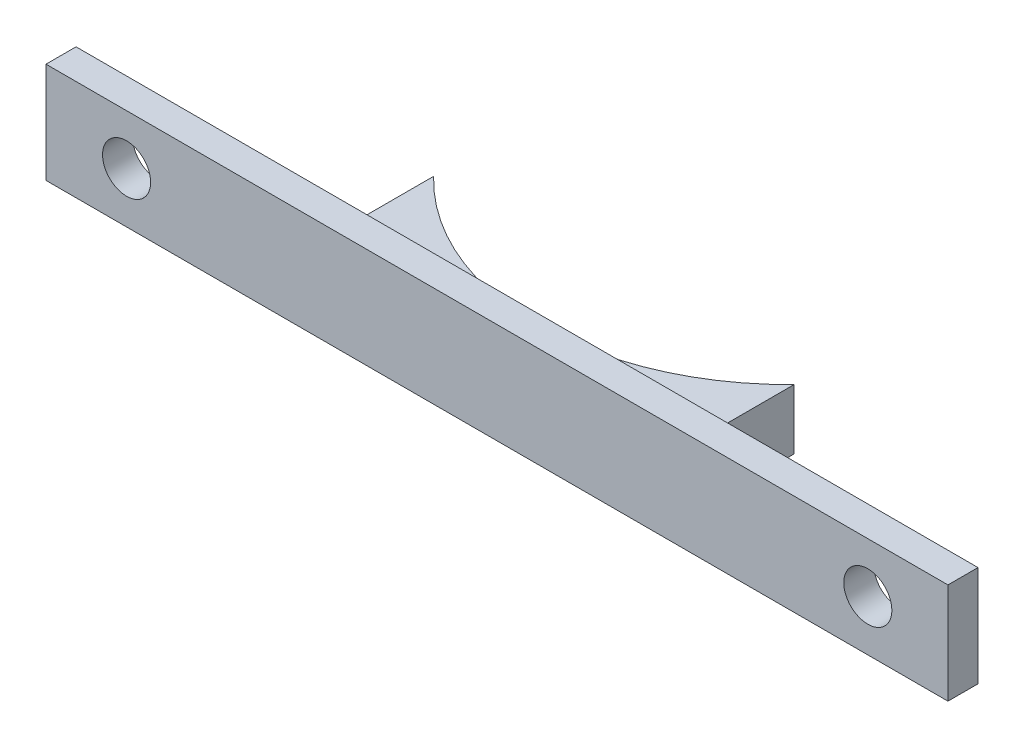
ISO-10303-21;
HEADER;
FILE_DESCRIPTION(('STEP AP214'),'2;1');
FILE_NAME('part.step','',(''),(''),'','','');
FILE_SCHEMA(('AUTOMOTIVE_DESIGN { 1 0 10303 214 1 1 1 1 }'));
ENDSEC;
DATA;
#1=APPLICATION_CONTEXT('core data for automotive mechanical design processes');
#2=APPLICATION_PROTOCOL_DEFINITION('international standard','automotive_design',2000,#1);
#3=PRODUCT_CONTEXT('',#1,'mechanical');
#4=PRODUCT('Part','Part','',(#3));
#5=PRODUCT_RELATED_PRODUCT_CATEGORY('part','',(#4));
#6=PRODUCT_DEFINITION_FORMATION('','',#4);
#7=PRODUCT_DEFINITION_CONTEXT('part definition',#1,'design');
#8=PRODUCT_DEFINITION('design','',#6,#7);
#9=PRODUCT_DEFINITION_SHAPE('','',#8);
#10=(LENGTH_UNIT() NAMED_UNIT(*) SI_UNIT(.MILLI.,.METRE.));
#11=(NAMED_UNIT(*) PLANE_ANGLE_UNIT() SI_UNIT($,.RADIAN.));
#12=(NAMED_UNIT(*) SI_UNIT($,.STERADIAN.) SOLID_ANGLE_UNIT());
#13=UNCERTAINTY_MEASURE_WITH_UNIT(LENGTH_MEASURE(1.E-05),#10,'distance_accuracy_value','');
#14=(GEOMETRIC_REPRESENTATION_CONTEXT(3) GLOBAL_UNCERTAINTY_ASSIGNED_CONTEXT((#13)) GLOBAL_UNIT_ASSIGNED_CONTEXT((#10,
#11,#12)) REPRESENTATION_CONTEXT('',''));
#15=CARTESIAN_POINT('',(0.,0.,0.));
#16=DIRECTION('',(0.,0.,1.));
#17=DIRECTION('',(1.,0.,0.));
#18=AXIS2_PLACEMENT_3D('',#15,#16,#17);
#19=CARTESIAN_POINT('',(0.,0.,0.));
#20=DIRECTION('',(0.,0.,1.));
#21=DIRECTION('',(1.,0.,0.));
#22=AXIS2_PLACEMENT_3D('',#19,#20,#21);
#23=PLANE('',#22);
#24=CARTESIAN_POINT('',(46.99,0.,0.));
#25=DIRECTION('',(0.,0.,1.));
#26=DIRECTION('',(1.,0.,0.));
#27=AXIS2_PLACEMENT_3D('',#24,#25,#26);
#28=CIRCLE('',#27,3.048);
#29=CARTESIAN_POINT('',(50.038,0.,0.));
#30=VERTEX_POINT('',#29);
#31=EDGE_CURVE('E169',#30,#30,#28,.T.);
#32=ORIENTED_EDGE('',*,*,#31,.T.);
#33=EDGE_LOOP('',(#32));
#34=FACE_BOUND('',#33,.T.);
#35=DIRECTION('',(1.,0.,0.));
#36=VECTOR('',#35,1.);
#37=CARTESIAN_POINT('',(0.,-6.41832615647092,0.));
#38=LINE('',#37,#36);
#39=CARTESIAN_POINT('',(-57.2065757126817,-6.41832615647092,0.));
#40=VERTEX_POINT('',#39);
#41=CARTESIAN_POINT('',(57.15,-6.41832615647092,0.));
#42=VERTEX_POINT('',#41);
#43=EDGE_CURVE('E188',#40,#42,#38,.T.);
#44=ORIENTED_EDGE('',*,*,#43,.F.);
#45=DIRECTION('',(0.,1.,0.));
#46=VECTOR('',#45,1.);
#47=CARTESIAN_POINT('',(-57.2065757126817,0.,0.));
#48=LINE('',#47,#46);
#49=CARTESIAN_POINT('',(-57.2065757126817,6.35,0.));
#50=VERTEX_POINT('',#49);
#51=EDGE_CURVE('E199',#40,#50,#48,.T.);
#52=ORIENTED_EDGE('',*,*,#51,.T.);
#53=DIRECTION('',(1.,0.,0.));
#54=VECTOR('',#53,1.);
#55=CARTESIAN_POINT('',(0.,6.35,0.));
#56=LINE('',#55,#54);
#57=CARTESIAN_POINT('',(57.15,6.35,0.));
#58=VERTEX_POINT('',#57);
#59=EDGE_CURVE('E195',#50,#58,#56,.T.);
#60=ORIENTED_EDGE('',*,*,#59,.T.);
#61=DIRECTION('',(0.,1.,0.));
#62=VECTOR('',#61,1.);
#63=CARTESIAN_POINT('',(57.15,0.,0.));
#64=LINE('',#63,#62);
#65=EDGE_CURVE('E191',#42,#58,#64,.T.);
#66=ORIENTED_EDGE('',*,*,#65,.F.);
#67=EDGE_LOOP('',(#44,#52,#60,#66));
#68=FACE_BOUND('',#67,.T.);
#69=CARTESIAN_POINT('',(-46.99,0.,0.));
#70=DIRECTION('',(0.,0.,1.));
#71=DIRECTION('',(1.,0.,0.));
#72=AXIS2_PLACEMENT_3D('',#69,#70,#71);
#73=CIRCLE('',#72,3.048);
#74=CARTESIAN_POINT('',(-43.942,0.,0.));
#75=VERTEX_POINT('',#74);
#76=EDGE_CURVE('E157',#75,#75,#73,.T.);
#77=ORIENTED_EDGE('',*,*,#76,.T.);
#78=EDGE_LOOP('',(#77));
#79=FACE_BOUND('',#78,.T.);
#80=DIRECTION('',(-1.,0.,0.));
#81=VECTOR('',#80,1.);
#82=CARTESIAN_POINT('',(0.,-3.81,0.));
#83=LINE('',#82,#81);
#84=CARTESIAN_POINT('',(22.86,-3.81,0.));
#85=VERTEX_POINT('',#84);
#86=CARTESIAN_POINT('',(-22.86,-3.81,0.));
#87=VERTEX_POINT('',#86);
#88=EDGE_CURVE('E149',#85,#87,#83,.T.);
#89=ORIENTED_EDGE('',*,*,#88,.F.);
#90=DIRECTION('',(0.,1.,0.));
#91=VECTOR('',#90,1.);
#92=CARTESIAN_POINT('',(22.86,-3.81,0.));
#93=LINE('',#92,#91);
#94=CARTESIAN_POINT('',(22.86,3.81,0.));
#95=VERTEX_POINT('',#94);
#96=EDGE_CURVE('E158',#85,#95,#93,.T.);
#97=ORIENTED_EDGE('',*,*,#96,.T.);
#98=DIRECTION('',(-1.,0.,0.));
#99=VECTOR('',#98,1.);
#100=CARTESIAN_POINT('',(0.,3.81,0.));
#101=LINE('',#100,#99);
#102=CARTESIAN_POINT('',(-22.86,3.81,0.));
#103=VERTEX_POINT('',#102);
#104=EDGE_CURVE('E132',#95,#103,#101,.T.);
#105=ORIENTED_EDGE('',*,*,#104,.T.);
#106=DIRECTION('',(0.,1.,0.));
#107=VECTOR('',#106,1.);
#108=CARTESIAN_POINT('',(-22.86,-3.81,0.));
#109=LINE('',#108,#107);
#110=EDGE_CURVE('E125',#87,#103,#109,.T.);
#111=ORIENTED_EDGE('',*,*,#110,.F.);
#112=EDGE_LOOP('',(#89,#97,#105,#111));
#113=FACE_BOUND('',#112,.T.);
#114=ADVANCED_FACE('F39',(#34,#68,#79,#113),#23,.F.);
#115=CARTESIAN_POINT('',(0.,-6.41832615647092,3.81));
#116=DIRECTION('',(0.,1.,0.));
#117=DIRECTION('',(0.,0.,1.));
#118=AXIS2_PLACEMENT_3D('',#115,#116,#117);
#119=PLANE('',#118);
#120=ORIENTED_EDGE('',*,*,#43,.T.);
#121=DIRECTION('',(0.,0.,-1.));
#122=VECTOR('',#121,1.);
#123=CARTESIAN_POINT('',(57.15,-6.41832615647092,3.81));
#124=LINE('',#123,#122);
#125=CARTESIAN_POINT('',(57.15,-6.41832615647092,3.81));
#126=VERTEX_POINT('',#125);
#127=EDGE_CURVE('E11',#126,#42,#124,.T.);
#128=ORIENTED_EDGE('',*,*,#127,.F.);
#129=DIRECTION('',(1.,0.,0.));
#130=VECTOR('',#129,1.);
#131=CARTESIAN_POINT('',(0.,-6.41832615647092,3.81));
#132=LINE('',#131,#130);
#133=CARTESIAN_POINT('',(-57.2065757126817,-6.41832615647092,3.81));
#134=VERTEX_POINT('',#133);
#135=EDGE_CURVE('E168',#134,#126,#132,.T.);
#136=ORIENTED_EDGE('',*,*,#135,.F.);
#137=DIRECTION('',(0.,0.,-1.));
#138=VECTOR('',#137,1.);
#139=CARTESIAN_POINT('',(-57.2065757126817,-6.41832615647092,3.81));
#140=LINE('',#139,#138);
#141=EDGE_CURVE('E64',#134,#40,#140,.T.);
#142=ORIENTED_EDGE('',*,*,#141,.T.);
#143=EDGE_LOOP('',(#120,#128,#136,#142));
#144=FACE_BOUND('',#143,.T.);
#145=ADVANCED_FACE('F224',(#144),#119,.F.);
#146=CARTESIAN_POINT('',(57.15,0.,3.81));
#147=DIRECTION('',(-1.,0.,0.));
#148=DIRECTION('',(0.,0.,1.));
#149=AXIS2_PLACEMENT_3D('',#146,#147,#148);
#150=PLANE('',#149);
#151=ORIENTED_EDGE('',*,*,#65,.T.);
#152=DIRECTION('',(0.,0.,-1.));
#153=VECTOR('',#152,1.);
#154=CARTESIAN_POINT('',(57.15,6.35,3.81));
#155=LINE('',#154,#153);
#156=CARTESIAN_POINT('',(57.15,6.35,3.81));
#157=VERTEX_POINT('',#156);
#158=EDGE_CURVE('E48',#157,#58,#155,.T.);
#159=ORIENTED_EDGE('',*,*,#158,.F.);
#160=DIRECTION('',(0.,1.,0.));
#161=VECTOR('',#160,1.);
#162=CARTESIAN_POINT('',(57.15,0.,3.81));
#163=LINE('',#162,#161);
#164=EDGE_CURVE('E90',#126,#157,#163,.T.);
#165=ORIENTED_EDGE('',*,*,#164,.F.);
#166=ORIENTED_EDGE('',*,*,#127,.T.);
#167=EDGE_LOOP('',(#151,#159,#165,#166));
#168=FACE_BOUND('',#167,.T.);
#169=ADVANCED_FACE('F215',(#168),#150,.F.);
#170=CARTESIAN_POINT('',(0.,6.35,3.81));
#171=DIRECTION('',(0.,1.,0.));
#172=DIRECTION('',(0.,0.,1.));
#173=AXIS2_PLACEMENT_3D('',#170,#171,#172);
#174=PLANE('',#173);
#175=ORIENTED_EDGE('',*,*,#59,.F.);
#176=DIRECTION('',(0.,0.,-1.));
#177=VECTOR('',#176,1.);
#178=CARTESIAN_POINT('',(-57.2065757126817,6.35,3.81));
#179=LINE('',#178,#177);
#180=CARTESIAN_POINT('',(-57.2065757126817,6.35,3.81));
#181=VERTEX_POINT('',#180);
#182=EDGE_CURVE('E208',#181,#50,#179,.T.);
#183=ORIENTED_EDGE('',*,*,#182,.F.);
#184=DIRECTION('',(1.,0.,0.));
#185=VECTOR('',#184,1.);
#186=CARTESIAN_POINT('',(0.,6.35,3.81));
#187=LINE('',#186,#185);
#188=EDGE_CURVE('E174',#181,#157,#187,.T.);
#189=ORIENTED_EDGE('',*,*,#188,.T.);
#190=ORIENTED_EDGE('',*,*,#158,.T.);
#191=EDGE_LOOP('',(#175,#183,#189,#190));
#192=FACE_BOUND('',#191,.T.);
#193=ADVANCED_FACE('F213',(#192),#174,.T.);
#194=CARTESIAN_POINT('',(-57.2065757126817,0.,3.81));
#195=DIRECTION('',(-1.,0.,0.));
#196=DIRECTION('',(0.,0.,1.));
#197=AXIS2_PLACEMENT_3D('',#194,#195,#196);
#198=PLANE('',#197);
#199=ORIENTED_EDGE('',*,*,#51,.F.);
#200=ORIENTED_EDGE('',*,*,#141,.F.);
#201=DIRECTION('',(0.,1.,0.));
#202=VECTOR('',#201,1.);
#203=CARTESIAN_POINT('',(-57.2065757126817,0.,3.81));
#204=LINE('',#203,#202);
#205=EDGE_CURVE('E178',#134,#181,#204,.T.);
#206=ORIENTED_EDGE('',*,*,#205,.T.);
#207=ORIENTED_EDGE('',*,*,#182,.T.);
#208=EDGE_LOOP('',(#199,#200,#206,#207));
#209=FACE_BOUND('',#208,.T.);
#210=ADVANCED_FACE('F219',(#209),#198,.T.);
#211=CARTESIAN_POINT('',(-46.99,0.,3.81));
#212=DIRECTION('',(0.,0.,-1.));
#213=DIRECTION('',(-1.,0.,0.));
#214=AXIS2_PLACEMENT_3D('',#211,#212,#213);
#215=CYLINDRICAL_SURFACE('',#214,3.048);
#216=CARTESIAN_POINT('',(-46.99,0.,3.81));
#217=DIRECTION('',(0.,0.,1.));
#218=DIRECTION('',(1.,0.,0.));
#219=AXIS2_PLACEMENT_3D('',#216,#217,#218);
#220=CIRCLE('',#219,3.048);
#221=CARTESIAN_POINT('',(-43.942,0.,3.81));
#222=VERTEX_POINT('',#221);
#223=EDGE_CURVE('E164',#222,#222,#220,.T.);
#224=ORIENTED_EDGE('',*,*,#223,.T.);
#225=EDGE_LOOP('',(#224));
#226=FACE_BOUND('',#225,.T.);
#227=ORIENTED_EDGE('',*,*,#76,.F.);
#228=EDGE_LOOP('',(#227));
#229=FACE_BOUND('',#228,.T.);
#230=ADVANCED_FACE('F41',(#226,#229),#215,.F.);
#231=CARTESIAN_POINT('',(46.99,0.,3.81));
#232=DIRECTION('',(0.,0.,-1.));
#233=DIRECTION('',(-1.,0.,0.));
#234=AXIS2_PLACEMENT_3D('',#231,#232,#233);
#235=CYLINDRICAL_SURFACE('',#234,3.048);
#236=CARTESIAN_POINT('',(46.99,0.,3.81));
#237=DIRECTION('',(0.,0.,1.));
#238=DIRECTION('',(1.,0.,0.));
#239=AXIS2_PLACEMENT_3D('',#236,#237,#238);
#240=CIRCLE('',#239,3.048);
#241=CARTESIAN_POINT('',(50.038,0.,3.81));
#242=VERTEX_POINT('',#241);
#243=EDGE_CURVE('E181',#242,#242,#240,.T.);
#244=ORIENTED_EDGE('',*,*,#243,.T.);
#245=EDGE_LOOP('',(#244));
#246=FACE_BOUND('',#245,.T.);
#247=ORIENTED_EDGE('',*,*,#31,.F.);
#248=EDGE_LOOP('',(#247));
#249=FACE_BOUND('',#248,.T.);
#250=ADVANCED_FACE('F238',(#246,#249),#235,.F.);
#251=CARTESIAN_POINT('',(0.,0.,3.81));
#252=DIRECTION('',(0.,0.,1.));
#253=DIRECTION('',(1.,0.,0.));
#254=AXIS2_PLACEMENT_3D('',#251,#252,#253);
#255=PLANE('',#254);
#256=ORIENTED_EDGE('',*,*,#223,.F.);
#257=EDGE_LOOP('',(#256));
#258=FACE_BOUND('',#257,.T.);
#259=ORIENTED_EDGE('',*,*,#135,.T.);
#260=ORIENTED_EDGE('',*,*,#164,.T.);
#261=ORIENTED_EDGE('',*,*,#188,.F.);
#262=ORIENTED_EDGE('',*,*,#205,.F.);
#263=EDGE_LOOP('',(#259,#260,#261,#262));
#264=FACE_BOUND('',#263,.T.);
#265=ORIENTED_EDGE('',*,*,#243,.F.);
#266=EDGE_LOOP('',(#265));
#267=FACE_BOUND('',#266,.T.);
#268=ADVANCED_FACE('F222',(#258,#264,#267),#255,.T.);
#269=CARTESIAN_POINT('',(0.,-3.81,-33.02));
#270=DIRECTION('',(0.,1.,0.));
#271=DIRECTION('',(0.,0.,1.));
#272=AXIS2_PLACEMENT_3D('',#269,#270,#271);
#273=CYLINDRICAL_SURFACE('',#272,31.75);
#274=DIRECTION('',(0.,1.,0.));
#275=VECTOR('',#274,1.);
#276=CARTESIAN_POINT('',(-22.86,-3.81,-10.9863235024202));
#277=LINE('',#276,#275);
#278=CARTESIAN_POINT('',(-22.86,-3.81,-10.9863235024202));
#279=VERTEX_POINT('',#278);
#280=CARTESIAN_POINT('',(-22.86,3.81,-10.9863235024202));
#281=VERTEX_POINT('',#280);
#282=EDGE_CURVE('E114',#279,#281,#277,.T.);
#283=ORIENTED_EDGE('',*,*,#282,.T.);
#284=CARTESIAN_POINT('',(0.,3.81,-33.02));
#285=DIRECTION('',(0.,1.,0.));
#286=DIRECTION('',(0.,0.,1.));
#287=AXIS2_PLACEMENT_3D('',#284,#285,#286);
#288=CIRCLE('',#287,31.75);
#289=CARTESIAN_POINT('',(22.86,3.81,-10.9863235024202));
#290=VERTEX_POINT('',#289);
#291=EDGE_CURVE('E117',#281,#290,#288,.T.);
#292=ORIENTED_EDGE('',*,*,#291,.T.);
#293=DIRECTION('',(0.,1.,0.));
#294=VECTOR('',#293,1.);
#295=CARTESIAN_POINT('',(22.86,-3.81,-10.9863235024202));
#296=LINE('',#295,#294);
#297=CARTESIAN_POINT('',(22.86,-3.81,-10.9863235024202));
#298=VERTEX_POINT('',#297);
#299=EDGE_CURVE('E154',#298,#290,#296,.T.);
#300=ORIENTED_EDGE('',*,*,#299,.F.);
#301=CARTESIAN_POINT('',(0.,-3.81,-33.02));
#302=DIRECTION('',(0.,1.,0.));
#303=DIRECTION('',(0.,0.,1.));
#304=AXIS2_PLACEMENT_3D('',#301,#302,#303);
#305=CIRCLE('',#304,31.75);
#306=EDGE_CURVE('E120',#279,#298,#305,.T.);
#307=ORIENTED_EDGE('',*,*,#306,.F.);
#308=EDGE_LOOP('',(#283,#292,#300,#307));
#309=FACE_BOUND('',#308,.T.);
#310=ADVANCED_FACE('F115',(#309),#273,.F.);
#311=CARTESIAN_POINT('',(22.86,-3.81,0.));
#312=DIRECTION('',(-1.,0.,0.));
#313=DIRECTION('',(0.,0.,1.));
#314=AXIS2_PLACEMENT_3D('',#311,#312,#313);
#315=PLANE('',#314);
#316=ORIENTED_EDGE('',*,*,#299,.T.);
#317=DIRECTION('',(0.,0.,1.));
#318=VECTOR('',#317,1.);
#319=CARTESIAN_POINT('',(22.86,3.81,0.));
#320=LINE('',#319,#318);
#321=EDGE_CURVE('E136',#290,#95,#320,.T.);
#322=ORIENTED_EDGE('',*,*,#321,.T.);
#323=ORIENTED_EDGE('',*,*,#96,.F.);
#324=DIRECTION('',(0.,0.,1.));
#325=VECTOR('',#324,1.);
#326=CARTESIAN_POINT('',(22.86,-3.81,0.));
#327=LINE('',#326,#325);
#328=EDGE_CURVE('E126',#298,#85,#327,.T.);
#329=ORIENTED_EDGE('',*,*,#328,.F.);
#330=EDGE_LOOP('',(#316,#322,#323,#329));
#331=FACE_BOUND('',#330,.T.);
#332=ADVANCED_FACE('F247',(#331),#315,.F.);
#333=CARTESIAN_POINT('',(-22.86,-3.81,0.));
#334=DIRECTION('',(-1.,0.,0.));
#335=DIRECTION('',(0.,0.,1.));
#336=AXIS2_PLACEMENT_3D('',#333,#334,#335);
#337=PLANE('',#336);
#338=ORIENTED_EDGE('',*,*,#110,.T.);
#339=DIRECTION('',(0.,0.,1.));
#340=VECTOR('',#339,1.);
#341=CARTESIAN_POINT('',(-22.86,3.81,0.));
#342=LINE('',#341,#340);
#343=EDGE_CURVE('E55',#281,#103,#342,.T.);
#344=ORIENTED_EDGE('',*,*,#343,.F.);
#345=ORIENTED_EDGE('',*,*,#282,.F.);
#346=DIRECTION('',(0.,0.,1.));
#347=VECTOR('',#346,1.);
#348=CARTESIAN_POINT('',(-22.86,-3.81,0.));
#349=LINE('',#348,#347);
#350=EDGE_CURVE('E146',#279,#87,#349,.T.);
#351=ORIENTED_EDGE('',*,*,#350,.T.);
#352=EDGE_LOOP('',(#338,#344,#345,#351));
#353=FACE_BOUND('',#352,.T.);
#354=ADVANCED_FACE('F128',(#353),#337,.T.);
#355=CARTESIAN_POINT('',(0.,-3.81,0.));
#356=DIRECTION('',(0.,1.,0.));
#357=DIRECTION('',(0.,0.,1.));
#358=AXIS2_PLACEMENT_3D('',#355,#356,#357);
#359=PLANE('',#358);
#360=ORIENTED_EDGE('',*,*,#306,.T.);
#361=ORIENTED_EDGE('',*,*,#328,.T.);
#362=ORIENTED_EDGE('',*,*,#88,.T.);
#363=ORIENTED_EDGE('',*,*,#350,.F.);
#364=EDGE_LOOP('',(#360,#361,#362,#363));
#365=FACE_BOUND('',#364,.T.);
#366=ADVANCED_FACE('F250',(#365),#359,.F.);
#367=CARTESIAN_POINT('',(0.,3.81,0.));
#368=DIRECTION('',(0.,1.,0.));
#369=DIRECTION('',(0.,0.,1.));
#370=AXIS2_PLACEMENT_3D('',#367,#368,#369);
#371=PLANE('',#370);
#372=ORIENTED_EDGE('',*,*,#291,.F.);
#373=ORIENTED_EDGE('',*,*,#343,.T.);
#374=ORIENTED_EDGE('',*,*,#104,.F.);
#375=ORIENTED_EDGE('',*,*,#321,.F.);
#376=EDGE_LOOP('',(#372,#373,#374,#375));
#377=FACE_BOUND('',#376,.T.);
#378=ADVANCED_FACE('F134',(#377),#371,.T.);
#379=CLOSED_SHELL('',(#114,#145,#169,#193,#210,#230,#250,#268,#310,#332,#354,#366,#378));
#380=MANIFOLD_SOLID_BREP('B2',#379);
#381=ADVANCED_BREP_SHAPE_REPRESENTATION('',(#18,#380),#14);
#382=SHAPE_DEFINITION_REPRESENTATION(#9,#381);
ENDSEC;
END-ISO-10303-21;
